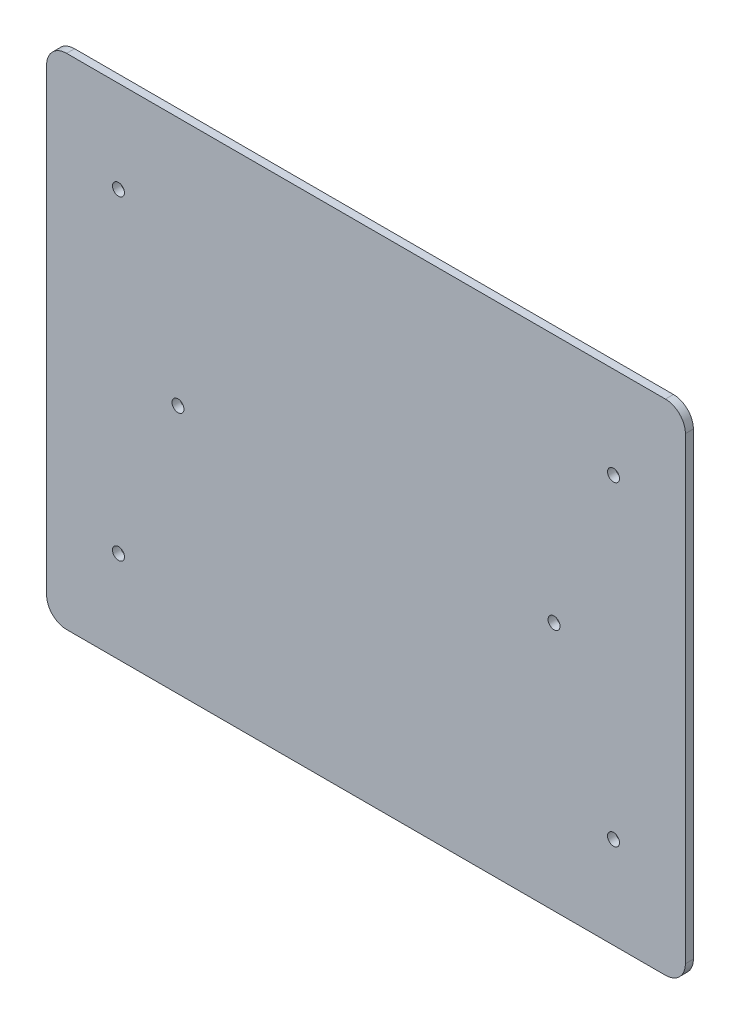
ISO-10303-21;
HEADER;
FILE_DESCRIPTION(('STEP AP214'),'2;1');
FILE_NAME('part.step','',(''),(''),'','','');
FILE_SCHEMA(('AUTOMOTIVE_DESIGN { 1 0 10303 214 1 1 1 1 }'));
ENDSEC;
DATA;
#1=APPLICATION_CONTEXT('core data for automotive mechanical design processes');
#2=APPLICATION_PROTOCOL_DEFINITION('international standard','automotive_design',2000,#1);
#3=PRODUCT_CONTEXT('',#1,'mechanical');
#4=PRODUCT('Part','Part','',(#3));
#5=PRODUCT_RELATED_PRODUCT_CATEGORY('part','',(#4));
#6=PRODUCT_DEFINITION_FORMATION('','',#4);
#7=PRODUCT_DEFINITION_CONTEXT('part definition',#1,'design');
#8=PRODUCT_DEFINITION('design','',#6,#7);
#9=PRODUCT_DEFINITION_SHAPE('','',#8);
#10=(LENGTH_UNIT() NAMED_UNIT(*) SI_UNIT(.MILLI.,.METRE.));
#11=(NAMED_UNIT(*) PLANE_ANGLE_UNIT() SI_UNIT($,.RADIAN.));
#12=(NAMED_UNIT(*) SI_UNIT($,.STERADIAN.) SOLID_ANGLE_UNIT());
#13=UNCERTAINTY_MEASURE_WITH_UNIT(LENGTH_MEASURE(1.E-05),#10,'distance_accuracy_value','');
#14=(GEOMETRIC_REPRESENTATION_CONTEXT(3) GLOBAL_UNCERTAINTY_ASSIGNED_CONTEXT((#13)) GLOBAL_UNIT_ASSIGNED_CONTEXT((#10,
#11,#12)) REPRESENTATION_CONTEXT('',''));
#15=CARTESIAN_POINT('',(0.,0.,0.));
#16=DIRECTION('',(0.,0.,1.));
#17=DIRECTION('',(1.,0.,0.));
#18=AXIS2_PLACEMENT_3D('',#15,#16,#17);
#19=CARTESIAN_POINT('',(-102.632364328177,-143.027068540586,2.));
#20=DIRECTION('',(0.,0.,-1.));
#21=DIRECTION('',(-1.,0.,0.));
#22=AXIS2_PLACEMENT_3D('',#19,#20,#21);
#23=CYLINDRICAL_SURFACE('',#22,5.);
#24=CARTESIAN_POINT('',(-102.632364328177,-143.027068540586,0.));
#25=DIRECTION('',(0.,0.,1.));
#26=DIRECTION('',(-1.,0.,0.));
#27=AXIS2_PLACEMENT_3D('',#24,#25,#26);
#28=CIRCLE('',#27,5.);
#29=CARTESIAN_POINT('',(-107.632364328177,-143.027068540586,0.));
#30=VERTEX_POINT('',#29);
#31=CARTESIAN_POINT('',(-102.632364328177,-148.027068540586,0.));
#32=VERTEX_POINT('',#31);
#33=EDGE_CURVE('E130',#30,#32,#28,.T.);
#34=ORIENTED_EDGE('',*,*,#33,.T.);
#35=DIRECTION('',(0.,0.,-1.));
#36=VECTOR('',#35,1.);
#37=CARTESIAN_POINT('',(-102.632364328177,-148.027068540586,2.));
#38=LINE('',#37,#36);
#39=CARTESIAN_POINT('',(-102.632364328177,-148.027068540586,2.));
#40=VERTEX_POINT('',#39);
#41=EDGE_CURVE('E11',#40,#32,#38,.T.);
#42=ORIENTED_EDGE('',*,*,#41,.F.);
#43=CARTESIAN_POINT('',(-102.632364328177,-143.027068540586,2.));
#44=DIRECTION('',(0.,0.,1.));
#45=DIRECTION('',(-1.,0.,0.));
#46=AXIS2_PLACEMENT_3D('',#43,#44,#45);
#47=CIRCLE('',#46,5.);
#48=CARTESIAN_POINT('',(-107.632364328177,-143.027068540586,2.));
#49=VERTEX_POINT('',#48);
#50=EDGE_CURVE('E145',#49,#40,#47,.T.);
#51=ORIENTED_EDGE('',*,*,#50,.F.);
#52=DIRECTION('',(0.,0.,-1.));
#53=VECTOR('',#52,1.);
#54=CARTESIAN_POINT('',(-107.632364328177,-143.027068540586,2.));
#55=LINE('',#54,#53);
#56=EDGE_CURVE('E126',#49,#30,#55,.T.);
#57=ORIENTED_EDGE('',*,*,#56,.T.);
#58=EDGE_LOOP('',(#34,#42,#51,#57));
#59=FACE_BOUND('',#58,.T.);
#60=ADVANCED_FACE('F34',(#59),#23,.T.);
#61=CARTESIAN_POINT('',(47.367635671823,-148.027068540586,2.));
#62=DIRECTION('',(0.,1.,0.));
#63=DIRECTION('',(0.,0.,1.));
#64=AXIS2_PLACEMENT_3D('',#61,#62,#63);
#65=PLANE('',#64);
#66=DIRECTION('',(1.,0.,0.));
#67=VECTOR('',#66,1.);
#68=CARTESIAN_POINT('',(47.367635671823,-148.027068540586,0.));
#69=LINE('',#68,#67);
#70=CARTESIAN_POINT('',(47.367635671823,-148.027068540586,0.));
#71=VERTEX_POINT('',#70);
#72=EDGE_CURVE('E133',#32,#71,#69,.T.);
#73=ORIENTED_EDGE('',*,*,#72,.T.);
#74=DIRECTION('',(0.,0.,-1.));
#75=VECTOR('',#74,1.);
#76=CARTESIAN_POINT('',(47.367635671823,-148.027068540586,2.));
#77=LINE('',#76,#75);
#78=CARTESIAN_POINT('',(47.367635671823,-148.027068540586,2.));
#79=VERTEX_POINT('',#78);
#80=EDGE_CURVE('E42',#79,#71,#77,.T.);
#81=ORIENTED_EDGE('',*,*,#80,.F.);
#82=DIRECTION('',(1.,0.,0.));
#83=VECTOR('',#82,1.);
#84=CARTESIAN_POINT('',(47.367635671823,-148.027068540586,2.));
#85=LINE('',#84,#83);
#86=EDGE_CURVE('E93',#40,#79,#85,.T.);
#87=ORIENTED_EDGE('',*,*,#86,.F.);
#88=ORIENTED_EDGE('',*,*,#41,.T.);
#89=EDGE_LOOP('',(#73,#81,#87,#88));
#90=FACE_BOUND('',#89,.T.);
#91=ADVANCED_FACE('F247',(#90),#65,.F.);
#92=CARTESIAN_POINT('',(47.3676356718231,-143.027068540586,2.));
#93=DIRECTION('',(0.,0.,-1.));
#94=DIRECTION('',(-1.,0.,0.));
#95=AXIS2_PLACEMENT_3D('',#92,#93,#94);
#96=CYLINDRICAL_SURFACE('',#95,5.);
#97=CARTESIAN_POINT('',(47.3676356718231,-143.027068540586,0.));
#98=DIRECTION('',(0.,0.,1.));
#99=DIRECTION('',(1.,0.,0.));
#100=AXIS2_PLACEMENT_3D('',#97,#98,#99);
#101=CIRCLE('',#100,5.);
#102=CARTESIAN_POINT('',(52.3676356718231,-143.027068540586,0.));
#103=VERTEX_POINT('',#102);
#104=EDGE_CURVE('E136',#71,#103,#101,.T.);
#105=ORIENTED_EDGE('',*,*,#104,.T.);
#106=DIRECTION('',(0.,0.,-1.));
#107=VECTOR('',#106,1.);
#108=CARTESIAN_POINT('',(52.3676356718231,-143.027068540586,2.));
#109=LINE('',#108,#107);
#110=CARTESIAN_POINT('',(52.3676356718231,-143.027068540586,2.));
#111=VERTEX_POINT('',#110);
#112=EDGE_CURVE('E152',#111,#103,#109,.T.);
#113=ORIENTED_EDGE('',*,*,#112,.F.);
#114=CARTESIAN_POINT('',(47.3676356718231,-143.027068540586,2.));
#115=DIRECTION('',(0.,0.,1.));
#116=DIRECTION('',(1.,0.,0.));
#117=AXIS2_PLACEMENT_3D('',#114,#115,#116);
#118=CIRCLE('',#117,5.);
#119=EDGE_CURVE('E160',#79,#111,#118,.T.);
#120=ORIENTED_EDGE('',*,*,#119,.F.);
#121=ORIENTED_EDGE('',*,*,#80,.T.);
#122=EDGE_LOOP('',(#105,#113,#120,#121));
#123=FACE_BOUND('',#122,.T.);
#124=ADVANCED_FACE('F158',(#123),#96,.T.);
#125=CARTESIAN_POINT('',(52.3676356718231,-143.027068540586,2.));
#126=DIRECTION('',(-1.,0.,0.));
#127=DIRECTION('',(0.,-1.,0.));
#128=AXIS2_PLACEMENT_3D('',#125,#126,#127);
#129=PLANE('',#128);
#130=DIRECTION('',(0.,1.,0.));
#131=VECTOR('',#130,1.);
#132=CARTESIAN_POINT('',(52.3676356718231,-143.027068540586,0.));
#133=LINE('',#132,#131);
#134=CARTESIAN_POINT('',(52.3676356718231,-28.0270685405863,0.));
#135=VERTEX_POINT('',#134);
#136=EDGE_CURVE('E138',#103,#135,#133,.T.);
#137=ORIENTED_EDGE('',*,*,#136,.T.);
#138=DIRECTION('',(0.,0.,-1.));
#139=VECTOR('',#138,1.);
#140=CARTESIAN_POINT('',(52.3676356718231,-28.0270685405863,2.));
#141=LINE('',#140,#139);
#142=CARTESIAN_POINT('',(52.3676356718231,-28.0270685405863,2.));
#143=VERTEX_POINT('',#142);
#144=EDGE_CURVE('E149',#143,#135,#141,.T.);
#145=ORIENTED_EDGE('',*,*,#144,.F.);
#146=DIRECTION('',(0.,1.,0.));
#147=VECTOR('',#146,1.);
#148=CARTESIAN_POINT('',(52.3676356718231,-143.027068540586,2.));
#149=LINE('',#148,#147);
#150=EDGE_CURVE('E172',#111,#143,#149,.T.);
#151=ORIENTED_EDGE('',*,*,#150,.F.);
#152=ORIENTED_EDGE('',*,*,#112,.T.);
#153=EDGE_LOOP('',(#137,#145,#151,#152));
#154=FACE_BOUND('',#153,.T.);
#155=ADVANCED_FACE('F168',(#154),#129,.F.);
#156=CARTESIAN_POINT('',(47.3676356718231,-28.0270685405863,2.));
#157=DIRECTION('',(0.,0.,-1.));
#158=DIRECTION('',(-1.,0.,0.));
#159=AXIS2_PLACEMENT_3D('',#156,#157,#158);
#160=CYLINDRICAL_SURFACE('',#159,5.);
#161=CARTESIAN_POINT('',(47.3676356718231,-28.0270685405863,0.));
#162=DIRECTION('',(0.,0.,1.));
#163=DIRECTION('',(1.,0.,0.));
#164=AXIS2_PLACEMENT_3D('',#161,#162,#163);
#165=CIRCLE('',#164,5.);
#166=CARTESIAN_POINT('',(47.3676356718231,-23.0270685405863,0.));
#167=VERTEX_POINT('',#166);
#168=EDGE_CURVE('E140',#135,#167,#165,.T.);
#169=ORIENTED_EDGE('',*,*,#168,.T.);
#170=DIRECTION('',(0.,0.,-1.));
#171=VECTOR('',#170,1.);
#172=CARTESIAN_POINT('',(47.3676356718231,-23.0270685405863,2.));
#173=LINE('',#172,#171);
#174=CARTESIAN_POINT('',(47.3676356718231,-23.0270685405863,2.));
#175=VERTEX_POINT('',#174);
#176=EDGE_CURVE('E121',#175,#167,#173,.T.);
#177=ORIENTED_EDGE('',*,*,#176,.F.);
#178=CARTESIAN_POINT('',(47.3676356718231,-28.0270685405863,2.));
#179=DIRECTION('',(0.,0.,1.));
#180=DIRECTION('',(1.,0.,0.));
#181=AXIS2_PLACEMENT_3D('',#178,#179,#180);
#182=CIRCLE('',#181,5.);
#183=EDGE_CURVE('E112',#143,#175,#182,.T.);
#184=ORIENTED_EDGE('',*,*,#183,.F.);
#185=ORIENTED_EDGE('',*,*,#144,.T.);
#186=EDGE_LOOP('',(#169,#177,#184,#185));
#187=FACE_BOUND('',#186,.T.);
#188=ADVANCED_FACE('F171',(#187),#160,.T.);
#189=CARTESIAN_POINT('',(47.3676356718231,-23.0270685405863,2.));
#190=DIRECTION('',(0.,-1.,0.));
#191=DIRECTION('',(1.,0.,0.));
#192=AXIS2_PLACEMENT_3D('',#189,#190,#191);
#193=PLANE('',#192);
#194=DIRECTION('',(-1.,0.,0.));
#195=VECTOR('',#194,1.);
#196=CARTESIAN_POINT('',(47.3676356718231,-23.0270685405863,0.));
#197=LINE('',#196,#195);
#198=CARTESIAN_POINT('',(-102.632364328177,-23.0270685405863,0.));
#199=VERTEX_POINT('',#198);
#200=EDGE_CURVE('E120',#167,#199,#197,.T.);
#201=ORIENTED_EDGE('',*,*,#200,.T.);
#202=DIRECTION('',(0.,0.,-1.));
#203=VECTOR('',#202,1.);
#204=CARTESIAN_POINT('',(-102.632364328177,-23.0270685405863,2.));
#205=LINE('',#204,#203);
#206=CARTESIAN_POINT('',(-102.632364328177,-23.0270685405863,2.));
#207=VERTEX_POINT('',#206);
#208=EDGE_CURVE('E117',#207,#199,#205,.T.);
#209=ORIENTED_EDGE('',*,*,#208,.F.);
#210=DIRECTION('',(-1.,0.,0.));
#211=VECTOR('',#210,1.);
#212=CARTESIAN_POINT('',(47.3676356718231,-23.0270685405863,2.));
#213=LINE('',#212,#211);
#214=EDGE_CURVE('E106',#175,#207,#213,.T.);
#215=ORIENTED_EDGE('',*,*,#214,.F.);
#216=ORIENTED_EDGE('',*,*,#176,.T.);
#217=EDGE_LOOP('',(#201,#209,#215,#216));
#218=FACE_BOUND('',#217,.T.);
#219=ADVANCED_FACE('F118',(#218),#193,.F.);
#220=CARTESIAN_POINT('',(-102.632364328177,-28.0270685405863,2.));
#221=DIRECTION('',(0.,0.,-1.));
#222=DIRECTION('',(-1.,0.,0.));
#223=AXIS2_PLACEMENT_3D('',#220,#221,#222);
#224=CYLINDRICAL_SURFACE('',#223,5.);
#225=CARTESIAN_POINT('',(-102.632364328177,-28.0270685405863,0.));
#226=DIRECTION('',(0.,0.,1.));
#227=DIRECTION('',(1.,0.,0.));
#228=AXIS2_PLACEMENT_3D('',#225,#226,#227);
#229=CIRCLE('',#228,5.);
#230=CARTESIAN_POINT('',(-107.632364328177,-28.0270685405863,0.));
#231=VERTEX_POINT('',#230);
#232=EDGE_CURVE('E79',#199,#231,#229,.T.);
#233=ORIENTED_EDGE('',*,*,#232,.T.);
#234=DIRECTION('',(0.,0.,-1.));
#235=VECTOR('',#234,1.);
#236=CARTESIAN_POINT('',(-107.632364328177,-28.0270685405863,2.));
#237=LINE('',#236,#235);
#238=CARTESIAN_POINT('',(-107.632364328177,-28.0270685405863,2.));
#239=VERTEX_POINT('',#238);
#240=EDGE_CURVE('E122',#239,#231,#237,.T.);
#241=ORIENTED_EDGE('',*,*,#240,.F.);
#242=CARTESIAN_POINT('',(-102.632364328177,-28.0270685405863,2.));
#243=DIRECTION('',(0.,0.,1.));
#244=DIRECTION('',(1.,0.,0.));
#245=AXIS2_PLACEMENT_3D('',#242,#243,#244);
#246=CIRCLE('',#245,5.);
#247=EDGE_CURVE('E110',#207,#239,#246,.T.);
#248=ORIENTED_EDGE('',*,*,#247,.F.);
#249=ORIENTED_EDGE('',*,*,#208,.T.);
#250=EDGE_LOOP('',(#233,#241,#248,#249));
#251=FACE_BOUND('',#250,.T.);
#252=ADVANCED_FACE('F124',(#251),#224,.T.);
#253=CARTESIAN_POINT('',(-107.632364328177,-143.027068540586,2.));
#254=DIRECTION('',(1.,0.,0.));
#255=DIRECTION('',(0.,0.,-1.));
#256=AXIS2_PLACEMENT_3D('',#253,#254,#255);
#257=PLANE('',#256);
#258=DIRECTION('',(0.,-1.,0.));
#259=VECTOR('',#258,1.);
#260=CARTESIAN_POINT('',(-107.632364328177,-143.027068540586,0.));
#261=LINE('',#260,#259);
#262=EDGE_CURVE('E85',#231,#30,#261,.T.);
#263=ORIENTED_EDGE('',*,*,#262,.T.);
#264=ORIENTED_EDGE('',*,*,#56,.F.);
#265=DIRECTION('',(0.,-1.,0.));
#266=VECTOR('',#265,1.);
#267=CARTESIAN_POINT('',(-107.632364328177,-143.027068540586,2.));
#268=LINE('',#267,#266);
#269=EDGE_CURVE('E50',#239,#49,#268,.T.);
#270=ORIENTED_EDGE('',*,*,#269,.F.);
#271=ORIENTED_EDGE('',*,*,#240,.T.);
#272=EDGE_LOOP('',(#263,#264,#270,#271));
#273=FACE_BOUND('',#272,.T.);
#274=ADVANCED_FACE('F238',(#273),#257,.F.);
#275=CARTESIAN_POINT('',(-102.632364328177,-143.027068540586,2.));
#276=DIRECTION('',(0.,0.,-1.));
#277=DIRECTION('',(-1.,0.,0.));
#278=AXIS2_PLACEMENT_3D('',#275,#276,#277);
#279=PLANE('',#278);
#280=CARTESIAN_POINT('',(19.4676356718231,-85.5270685405863,2.));
#281=DIRECTION('',(0.,0.,-1.));
#282=DIRECTION('',(-1.,0.,0.));
#283=AXIS2_PLACEMENT_3D('',#280,#281,#282);
#284=CIRCLE('',#283,1.5);
#285=CARTESIAN_POINT('',(17.9676356718231,-85.5270685405863,2.));
#286=VERTEX_POINT('',#285);
#287=EDGE_CURVE('E183',#286,#286,#284,.T.);
#288=ORIENTED_EDGE('',*,*,#287,.T.);
#289=EDGE_LOOP('',(#288));
#290=FACE_BOUND('',#289,.T.);
#291=CARTESIAN_POINT('',(34.3676356718231,-46.0270685405863,2.));
#292=DIRECTION('',(0.,0.,-1.));
#293=DIRECTION('',(-1.,0.,0.));
#294=AXIS2_PLACEMENT_3D('',#291,#292,#293);
#295=CIRCLE('',#294,1.5);
#296=CARTESIAN_POINT('',(32.8676356718231,-46.0270685405863,2.));
#297=VERTEX_POINT('',#296);
#298=EDGE_CURVE('E186',#297,#297,#295,.T.);
#299=ORIENTED_EDGE('',*,*,#298,.T.);
#300=EDGE_LOOP('',(#299));
#301=FACE_BOUND('',#300,.T.);
#302=CARTESIAN_POINT('',(-89.6323643281769,-46.0270685405863,2.));
#303=DIRECTION('',(0.,0.,-1.));
#304=DIRECTION('',(-1.,0.,0.));
#305=AXIS2_PLACEMENT_3D('',#302,#303,#304);
#306=CIRCLE('',#305,1.50000000000003);
#307=CARTESIAN_POINT('',(-91.1323643281769,-46.0270685405863,2.));
#308=VERTEX_POINT('',#307);
#309=EDGE_CURVE('E189',#308,#308,#306,.T.);
#310=ORIENTED_EDGE('',*,*,#309,.T.);
#311=EDGE_LOOP('',(#310));
#312=FACE_BOUND('',#311,.T.);
#313=CARTESIAN_POINT('',(-74.7323643281769,-85.5270685405863,2.));
#314=DIRECTION('',(0.,0.,-1.));
#315=DIRECTION('',(-1.,0.,0.));
#316=AXIS2_PLACEMENT_3D('',#313,#314,#315);
#317=CIRCLE('',#316,1.5);
#318=CARTESIAN_POINT('',(-76.2323643281769,-85.5270685405863,2.));
#319=VERTEX_POINT('',#318);
#320=EDGE_CURVE('E192',#319,#319,#317,.T.);
#321=ORIENTED_EDGE('',*,*,#320,.T.);
#322=EDGE_LOOP('',(#321));
#323=FACE_BOUND('',#322,.T.);
#324=CARTESIAN_POINT('',(-89.6323643281769,-125.027068540586,2.));
#325=DIRECTION('',(0.,0.,-1.));
#326=DIRECTION('',(-1.,0.,0.));
#327=AXIS2_PLACEMENT_3D('',#324,#325,#326);
#328=CIRCLE('',#327,1.50000000000003);
#329=CARTESIAN_POINT('',(-91.1323643281769,-125.027068540586,2.));
#330=VERTEX_POINT('',#329);
#331=EDGE_CURVE('E195',#330,#330,#328,.T.);
#332=ORIENTED_EDGE('',*,*,#331,.T.);
#333=EDGE_LOOP('',(#332));
#334=FACE_BOUND('',#333,.T.);
#335=CARTESIAN_POINT('',(34.3676356718231,-125.027068540586,2.));
#336=DIRECTION('',(0.,0.,-1.));
#337=DIRECTION('',(-1.,0.,0.));
#338=AXIS2_PLACEMENT_3D('',#335,#336,#337);
#339=CIRCLE('',#338,1.5);
#340=CARTESIAN_POINT('',(32.8676356718231,-125.027068540586,2.));
#341=VERTEX_POINT('',#340);
#342=EDGE_CURVE('E134',#341,#341,#339,.T.);
#343=ORIENTED_EDGE('',*,*,#342,.T.);
#344=EDGE_LOOP('',(#343));
#345=FACE_BOUND('',#344,.T.);
#346=ORIENTED_EDGE('',*,*,#50,.T.);
#347=ORIENTED_EDGE('',*,*,#86,.T.);
#348=ORIENTED_EDGE('',*,*,#119,.T.);
#349=ORIENTED_EDGE('',*,*,#150,.T.);
#350=ORIENTED_EDGE('',*,*,#183,.T.);
#351=ORIENTED_EDGE('',*,*,#214,.T.);
#352=ORIENTED_EDGE('',*,*,#247,.T.);
#353=ORIENTED_EDGE('',*,*,#269,.T.);
#354=EDGE_LOOP('',(#346,#347,#348,#349,#350,#351,#352,#353));
#355=FACE_BOUND('',#354,.T.);
#356=ADVANCED_FACE('F108',(#290,#301,#312,#323,#334,#345,#355),#279,.F.);
#357=CARTESIAN_POINT('',(-102.632364328177,-143.027068540586,0.));
#358=DIRECTION('',(0.,0.,-1.));
#359=DIRECTION('',(-1.,0.,0.));
#360=AXIS2_PLACEMENT_3D('',#357,#358,#359);
#361=PLANE('',#360);
#362=CARTESIAN_POINT('',(19.4676356718231,-85.5270685405863,0.));
#363=DIRECTION('',(0.,0.,-1.));
#364=DIRECTION('',(-1.,0.,0.));
#365=AXIS2_PLACEMENT_3D('',#362,#363,#364);
#366=CIRCLE('',#365,1.5);
#367=CARTESIAN_POINT('',(17.9676356718231,-85.5270685405863,0.));
#368=VERTEX_POINT('',#367);
#369=EDGE_CURVE('E198',#368,#368,#366,.T.);
#370=ORIENTED_EDGE('',*,*,#369,.F.);
#371=EDGE_LOOP('',(#370));
#372=FACE_BOUND('',#371,.T.);
#373=CARTESIAN_POINT('',(34.3676356718231,-46.0270685405863,0.));
#374=DIRECTION('',(0.,0.,-1.));
#375=DIRECTION('',(-1.,0.,0.));
#376=AXIS2_PLACEMENT_3D('',#373,#374,#375);
#377=CIRCLE('',#376,1.5);
#378=CARTESIAN_POINT('',(32.8676356718231,-46.0270685405863,0.));
#379=VERTEX_POINT('',#378);
#380=EDGE_CURVE('E208',#379,#379,#377,.T.);
#381=ORIENTED_EDGE('',*,*,#380,.F.);
#382=EDGE_LOOP('',(#381));
#383=FACE_BOUND('',#382,.T.);
#384=CARTESIAN_POINT('',(-89.6323643281769,-46.0270685405863,0.));
#385=DIRECTION('',(0.,0.,-1.));
#386=DIRECTION('',(1.,0.,0.));
#387=AXIS2_PLACEMENT_3D('',#384,#385,#386);
#388=CIRCLE('',#387,1.50000000000003);
#389=CARTESIAN_POINT('',(-88.1323643281769,-46.0270685405863,0.));
#390=VERTEX_POINT('',#389);
#391=EDGE_CURVE('E205',#390,#390,#388,.T.);
#392=ORIENTED_EDGE('',*,*,#391,.F.);
#393=EDGE_LOOP('',(#392));
#394=FACE_BOUND('',#393,.T.);
#395=CARTESIAN_POINT('',(-74.7323643281769,-85.5270685405863,0.));
#396=DIRECTION('',(0.,0.,-1.));
#397=DIRECTION('',(1.,0.,0.));
#398=AXIS2_PLACEMENT_3D('',#395,#396,#397);
#399=CIRCLE('',#398,1.5);
#400=CARTESIAN_POINT('',(-73.2323643281769,-85.5270685405863,0.));
#401=VERTEX_POINT('',#400);
#402=EDGE_CURVE('E202',#401,#401,#399,.T.);
#403=ORIENTED_EDGE('',*,*,#402,.F.);
#404=EDGE_LOOP('',(#403));
#405=FACE_BOUND('',#404,.T.);
#406=CARTESIAN_POINT('',(-89.6323643281769,-125.027068540586,0.));
#407=DIRECTION('',(0.,0.,-1.));
#408=DIRECTION('',(1.,0.,0.));
#409=AXIS2_PLACEMENT_3D('',#406,#407,#408);
#410=CIRCLE('',#409,1.50000000000003);
#411=CARTESIAN_POINT('',(-88.1323643281769,-125.027068540586,0.));
#412=VERTEX_POINT('',#411);
#413=EDGE_CURVE('E199',#412,#412,#410,.T.);
#414=ORIENTED_EDGE('',*,*,#413,.F.);
#415=EDGE_LOOP('',(#414));
#416=FACE_BOUND('',#415,.T.);
#417=CARTESIAN_POINT('',(34.3676356718231,-125.027068540586,0.));
#418=DIRECTION('',(0.,0.,-1.));
#419=DIRECTION('',(-1.,0.,0.));
#420=AXIS2_PLACEMENT_3D('',#417,#418,#419);
#421=CIRCLE('',#420,1.5);
#422=CARTESIAN_POINT('',(32.8676356718231,-125.027068540586,0.));
#423=VERTEX_POINT('',#422);
#424=EDGE_CURVE('E180',#423,#423,#421,.T.);
#425=ORIENTED_EDGE('',*,*,#424,.F.);
#426=EDGE_LOOP('',(#425));
#427=FACE_BOUND('',#426,.T.);
#428=ORIENTED_EDGE('',*,*,#33,.F.);
#429=ORIENTED_EDGE('',*,*,#262,.F.);
#430=ORIENTED_EDGE('',*,*,#232,.F.);
#431=ORIENTED_EDGE('',*,*,#200,.F.);
#432=ORIENTED_EDGE('',*,*,#168,.F.);
#433=ORIENTED_EDGE('',*,*,#136,.F.);
#434=ORIENTED_EDGE('',*,*,#104,.F.);
#435=ORIENTED_EDGE('',*,*,#72,.F.);
#436=EDGE_LOOP('',(#428,#429,#430,#431,#432,#433,#434,#435));
#437=FACE_BOUND('',#436,.T.);
#438=ADVANCED_FACE('F164',(#372,#383,#394,#405,#416,#427,#437),#361,.T.);
#439=CARTESIAN_POINT('',(34.3676356718231,-125.027068540586,10.));
#440=DIRECTION('',(0.,0.,-1.));
#441=DIRECTION('',(-1.,0.,0.));
#442=AXIS2_PLACEMENT_3D('',#439,#440,#441);
#443=CYLINDRICAL_SURFACE('',#442,1.5);
#444=ORIENTED_EDGE('',*,*,#424,.T.);
#445=EDGE_LOOP('',(#444));
#446=FACE_BOUND('',#445,.T.);
#447=ORIENTED_EDGE('',*,*,#342,.F.);
#448=EDGE_LOOP('',(#447));
#449=FACE_BOUND('',#448,.T.);
#450=ADVANCED_FACE('F219',(#446,#449),#443,.F.);
#451=CARTESIAN_POINT('',(-89.6323643281769,-125.027068540586,10.));
#452=DIRECTION('',(0.,0.,-1.));
#453=DIRECTION('',(-1.,0.,0.));
#454=AXIS2_PLACEMENT_3D('',#451,#452,#453);
#455=CYLINDRICAL_SURFACE('',#454,1.50000000000003);
#456=ORIENTED_EDGE('',*,*,#413,.T.);
#457=EDGE_LOOP('',(#456));
#458=FACE_BOUND('',#457,.T.);
#459=ORIENTED_EDGE('',*,*,#331,.F.);
#460=EDGE_LOOP('',(#459));
#461=FACE_BOUND('',#460,.T.);
#462=ADVANCED_FACE('F233',(#458,#461),#455,.F.);
#463=CARTESIAN_POINT('',(-74.7323643281769,-85.5270685405863,10.));
#464=DIRECTION('',(0.,0.,-1.));
#465=DIRECTION('',(-1.,0.,0.));
#466=AXIS2_PLACEMENT_3D('',#463,#464,#465);
#467=CYLINDRICAL_SURFACE('',#466,1.5);
#468=ORIENTED_EDGE('',*,*,#402,.T.);
#469=EDGE_LOOP('',(#468));
#470=FACE_BOUND('',#469,.T.);
#471=ORIENTED_EDGE('',*,*,#320,.F.);
#472=EDGE_LOOP('',(#471));
#473=FACE_BOUND('',#472,.T.);
#474=ADVANCED_FACE('F299',(#470,#473),#467,.F.);
#475=CARTESIAN_POINT('',(-89.6323643281769,-46.0270685405863,10.));
#476=DIRECTION('',(0.,0.,-1.));
#477=DIRECTION('',(-1.,0.,0.));
#478=AXIS2_PLACEMENT_3D('',#475,#476,#477);
#479=CYLINDRICAL_SURFACE('',#478,1.50000000000003);
#480=ORIENTED_EDGE('',*,*,#391,.T.);
#481=EDGE_LOOP('',(#480));
#482=FACE_BOUND('',#481,.T.);
#483=ORIENTED_EDGE('',*,*,#309,.F.);
#484=EDGE_LOOP('',(#483));
#485=FACE_BOUND('',#484,.T.);
#486=ADVANCED_FACE('F309',(#482,#485),#479,.F.);
#487=CARTESIAN_POINT('',(34.3676356718231,-46.0270685405863,10.));
#488=DIRECTION('',(0.,0.,-1.));
#489=DIRECTION('',(-1.,0.,0.));
#490=AXIS2_PLACEMENT_3D('',#487,#488,#489);
#491=CYLINDRICAL_SURFACE('',#490,1.5);
#492=ORIENTED_EDGE('',*,*,#380,.T.);
#493=EDGE_LOOP('',(#492));
#494=FACE_BOUND('',#493,.T.);
#495=ORIENTED_EDGE('',*,*,#298,.F.);
#496=EDGE_LOOP('',(#495));
#497=FACE_BOUND('',#496,.T.);
#498=ADVANCED_FACE('F319',(#494,#497),#491,.F.);
#499=CARTESIAN_POINT('',(19.4676356718231,-85.5270685405863,10.));
#500=DIRECTION('',(0.,0.,-1.));
#501=DIRECTION('',(-1.,0.,0.));
#502=AXIS2_PLACEMENT_3D('',#499,#500,#501);
#503=CYLINDRICAL_SURFACE('',#502,1.5);
#504=ORIENTED_EDGE('',*,*,#369,.T.);
#505=EDGE_LOOP('',(#504));
#506=FACE_BOUND('',#505,.T.);
#507=ORIENTED_EDGE('',*,*,#287,.F.);
#508=EDGE_LOOP('',(#507));
#509=FACE_BOUND('',#508,.T.);
#510=ADVANCED_FACE('F214',(#506,#509),#503,.F.);
#511=CLOSED_SHELL('',(#60,#91,#124,#155,#188,#219,#252,#274,#356,#438,#450,#462,#474,#486,#498,#510));
#512=MANIFOLD_SOLID_BREP('B2',#511);
#513=ADVANCED_BREP_SHAPE_REPRESENTATION('',(#18,#512),#14);
#514=SHAPE_DEFINITION_REPRESENTATION(#9,#513);
ENDSEC;
END-ISO-10303-21;
